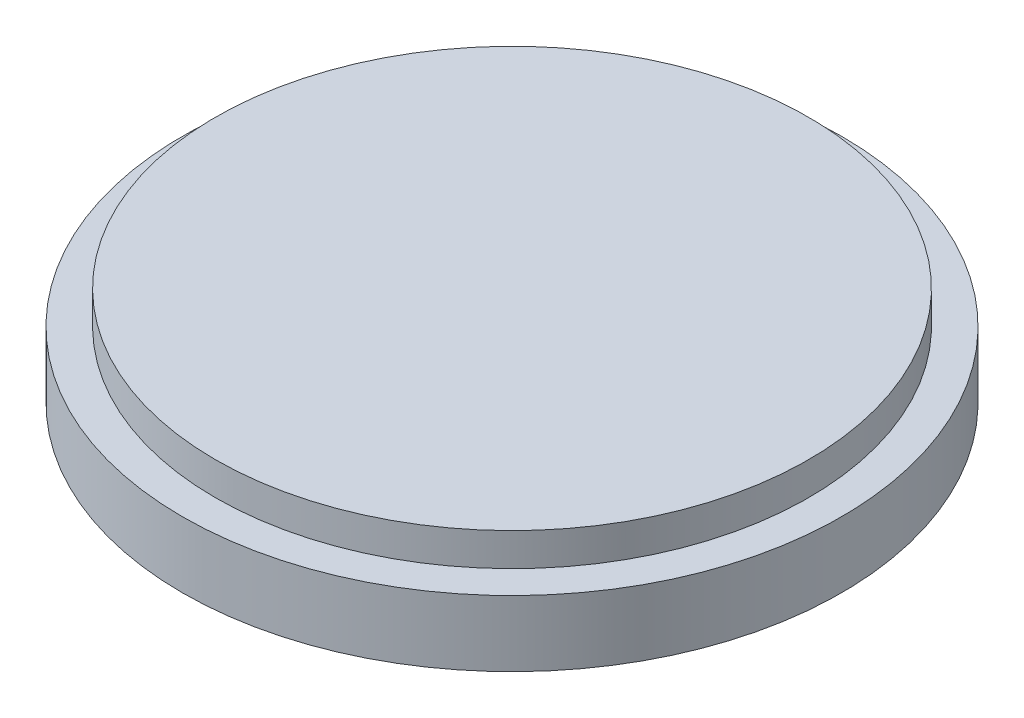
ISO-10303-21;
HEADER;
FILE_DESCRIPTION(('STEP AP214'),'2;1');
FILE_NAME('part.step','',(''),(''),'','','');
FILE_SCHEMA(('AUTOMOTIVE_DESIGN { 1 0 10303 214 1 1 1 1 }'));
ENDSEC;
DATA;
#1=APPLICATION_CONTEXT('core data for automotive mechanical design processes');
#2=APPLICATION_PROTOCOL_DEFINITION('international standard','automotive_design',2000,#1);
#3=PRODUCT_CONTEXT('',#1,'mechanical');
#4=PRODUCT('Part','Part','',(#3));
#5=PRODUCT_RELATED_PRODUCT_CATEGORY('part','',(#4));
#6=PRODUCT_DEFINITION_FORMATION('','',#4);
#7=PRODUCT_DEFINITION_CONTEXT('part definition',#1,'design');
#8=PRODUCT_DEFINITION('design','',#6,#7);
#9=PRODUCT_DEFINITION_SHAPE('','',#8);
#10=(LENGTH_UNIT() NAMED_UNIT(*) SI_UNIT(.MILLI.,.METRE.));
#11=(NAMED_UNIT(*) PLANE_ANGLE_UNIT() SI_UNIT($,.RADIAN.));
#12=(NAMED_UNIT(*) SI_UNIT($,.STERADIAN.) SOLID_ANGLE_UNIT());
#13=UNCERTAINTY_MEASURE_WITH_UNIT(LENGTH_MEASURE(1.E-05),#10,'distance_accuracy_value','');
#14=(GEOMETRIC_REPRESENTATION_CONTEXT(3) GLOBAL_UNCERTAINTY_ASSIGNED_CONTEXT((#13)) GLOBAL_UNIT_ASSIGNED_CONTEXT((#10,
#11,#12)) REPRESENTATION_CONTEXT('',''));
#15=CARTESIAN_POINT('',(0.,0.,0.));
#16=DIRECTION('',(0.,0.,1.));
#17=DIRECTION('',(1.,0.,0.));
#18=AXIS2_PLACEMENT_3D('',#15,#16,#17);
#19=CARTESIAN_POINT('',(0.,5.,0.));
#20=DIRECTION('',(0.,-1.,0.));
#21=DIRECTION('',(0.,0.,-1.));
#22=AXIS2_PLACEMENT_3D('',#19,#20,#21);
#23=CYLINDRICAL_SURFACE('',#22,25.);
#24=CARTESIAN_POINT('',(0.,5.,0.));
#25=DIRECTION('',(0.,1.,0.));
#26=DIRECTION('',(0.,0.,1.));
#27=AXIS2_PLACEMENT_3D('',#24,#25,#26);
#28=CIRCLE('',#27,25.);
#29=CARTESIAN_POINT('',(0.,5.,25.));
#30=VERTEX_POINT('',#29);
#31=EDGE_CURVE('E45',#30,#30,#28,.T.);
#32=ORIENTED_EDGE('',*,*,#31,.F.);
#33=EDGE_LOOP('',(#32));
#34=FACE_BOUND('',#33,.T.);
#35=CARTESIAN_POINT('',(0.,0.,0.));
#36=DIRECTION('',(0.,1.,0.));
#37=DIRECTION('',(0.,0.,1.));
#38=AXIS2_PLACEMENT_3D('',#35,#36,#37);
#39=CIRCLE('',#38,25.);
#40=CARTESIAN_POINT('',(0.,0.,25.));
#41=VERTEX_POINT('',#40);
#42=EDGE_CURVE('E40',#41,#41,#39,.T.);
#43=ORIENTED_EDGE('',*,*,#42,.T.);
#44=EDGE_LOOP('',(#43));
#45=FACE_BOUND('',#44,.T.);
#46=ADVANCED_FACE('F37',(#34,#45),#23,.T.);
#47=CARTESIAN_POINT('',(0.,5.,0.));
#48=DIRECTION('',(0.,1.,0.));
#49=DIRECTION('',(0.,0.,1.));
#50=AXIS2_PLACEMENT_3D('',#47,#48,#49);
#51=PLANE('',#50);
#52=CARTESIAN_POINT('',(0.,5.,0.));
#53=DIRECTION('',(0.,1.,0.));
#54=DIRECTION('',(0.,0.,1.));
#55=AXIS2_PLACEMENT_3D('',#52,#53,#54);
#56=CIRCLE('',#55,22.5);
#57=CARTESIAN_POINT('',(0.,5.,22.5));
#58=VERTEX_POINT('',#57);
#59=EDGE_CURVE('E10',#58,#58,#56,.T.);
#60=ORIENTED_EDGE('',*,*,#59,.F.);
#61=EDGE_LOOP('',(#60));
#62=FACE_BOUND('',#61,.T.);
#63=ORIENTED_EDGE('',*,*,#31,.T.);
#64=EDGE_LOOP('',(#63));
#65=FACE_BOUND('',#64,.T.);
#66=ADVANCED_FACE('F65',(#62,#65),#51,.T.);
#67=CARTESIAN_POINT('',(0.,0.,0.));
#68=DIRECTION('',(0.,1.,0.));
#69=DIRECTION('',(0.,0.,1.));
#70=AXIS2_PLACEMENT_3D('',#67,#68,#69);
#71=PLANE('',#70);
#72=ORIENTED_EDGE('',*,*,#42,.F.);
#73=EDGE_LOOP('',(#72));
#74=FACE_BOUND('',#73,.T.);
#75=ADVANCED_FACE('F62',(#74),#71,.F.);
#76=CARTESIAN_POINT('',(0.,7.5,0.));
#77=DIRECTION('',(0.,-1.,0.));
#78=DIRECTION('',(0.,0.,-1.));
#79=AXIS2_PLACEMENT_3D('',#76,#77,#78);
#80=CYLINDRICAL_SURFACE('',#79,22.5);
#81=CARTESIAN_POINT('',(0.,7.5,0.));
#82=DIRECTION('',(0.,1.,0.));
#83=DIRECTION('',(0.,0.,1.));
#84=AXIS2_PLACEMENT_3D('',#81,#82,#83);
#85=CIRCLE('',#84,22.5);
#86=CARTESIAN_POINT('',(0.,7.5,22.5));
#87=VERTEX_POINT('',#86);
#88=EDGE_CURVE('E52',#87,#87,#85,.T.);
#89=ORIENTED_EDGE('',*,*,#88,.F.);
#90=EDGE_LOOP('',(#89));
#91=FACE_BOUND('',#90,.T.);
#92=ORIENTED_EDGE('',*,*,#59,.T.);
#93=EDGE_LOOP('',(#92));
#94=FACE_BOUND('',#93,.T.);
#95=ADVANCED_FACE('F64',(#91,#94),#80,.T.);
#96=CARTESIAN_POINT('',(0.,7.5,0.));
#97=DIRECTION('',(0.,1.,0.));
#98=DIRECTION('',(0.,0.,1.));
#99=AXIS2_PLACEMENT_3D('',#96,#97,#98);
#100=PLANE('',#99);
#101=ORIENTED_EDGE('',*,*,#88,.T.);
#102=EDGE_LOOP('',(#101));
#103=FACE_BOUND('',#102,.T.);
#104=ADVANCED_FACE('F70',(#103),#100,.T.);
#105=CLOSED_SHELL('',(#46,#66,#75,#95,#104));
#106=MANIFOLD_SOLID_BREP('B2',#105);
#107=ADVANCED_BREP_SHAPE_REPRESENTATION('',(#18,#106),#14);
#108=SHAPE_DEFINITION_REPRESENTATION(#9,#107);
ENDSEC;
END-ISO-10303-21;
